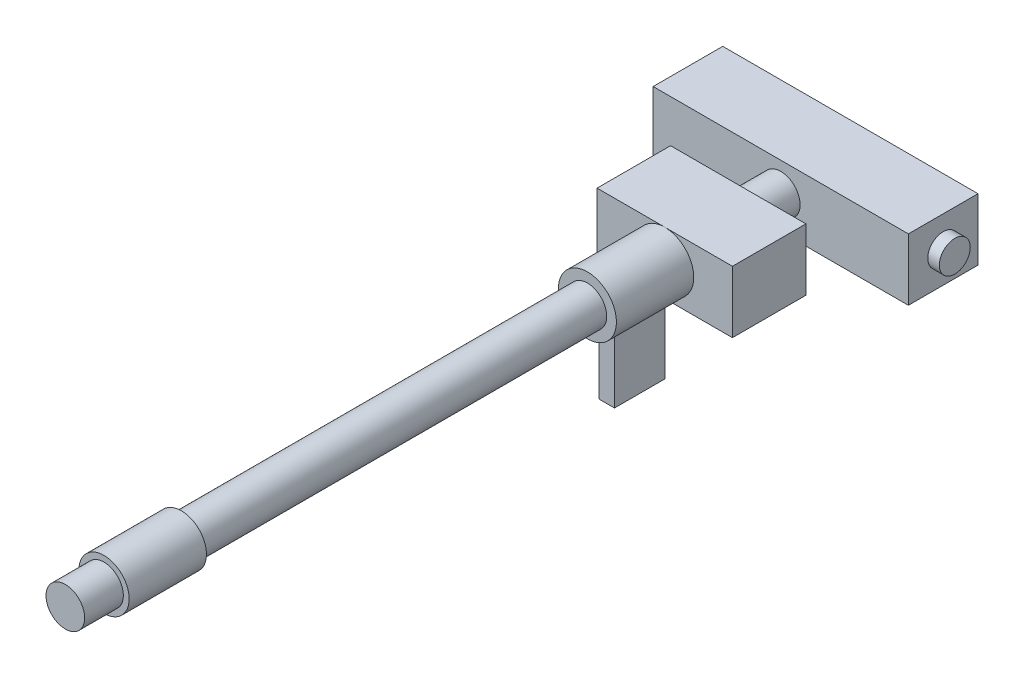
ISO-10303-21;
HEADER;
FILE_DESCRIPTION(('STEP AP214'),'2;1');
FILE_NAME('part.step','',(''),(''),'','','');
FILE_SCHEMA(('AUTOMOTIVE_DESIGN { 1 0 10303 214 1 1 1 1 }'));
ENDSEC;
DATA;
#1=APPLICATION_CONTEXT('core data for automotive mechanical design processes');
#2=APPLICATION_PROTOCOL_DEFINITION('international standard','automotive_design',2000,#1);
#3=PRODUCT_CONTEXT('',#1,'mechanical');
#4=PRODUCT('Part','Part','',(#3));
#5=PRODUCT_RELATED_PRODUCT_CATEGORY('part','',(#4));
#6=PRODUCT_DEFINITION_FORMATION('','',#4);
#7=PRODUCT_DEFINITION_CONTEXT('part definition',#1,'design');
#8=PRODUCT_DEFINITION('design','',#6,#7);
#9=PRODUCT_DEFINITION_SHAPE('','',#8);
#10=(LENGTH_UNIT() NAMED_UNIT(*) SI_UNIT(.MILLI.,.METRE.));
#11=(NAMED_UNIT(*) PLANE_ANGLE_UNIT() SI_UNIT($,.RADIAN.));
#12=(NAMED_UNIT(*) SI_UNIT($,.STERADIAN.) SOLID_ANGLE_UNIT());
#13=UNCERTAINTY_MEASURE_WITH_UNIT(LENGTH_MEASURE(1.E-05),#10,'distance_accuracy_value','');
#14=(GEOMETRIC_REPRESENTATION_CONTEXT(3) GLOBAL_UNCERTAINTY_ASSIGNED_CONTEXT((#13)) GLOBAL_UNIT_ASSIGNED_CONTEXT((#10,
#11,#12)) REPRESENTATION_CONTEXT('',''));
#15=CARTESIAN_POINT('',(0.,0.,0.));
#16=DIRECTION('',(0.,0.,1.));
#17=DIRECTION('',(1.,0.,0.));
#18=AXIS2_PLACEMENT_3D('',#15,#16,#17);
#19=CARTESIAN_POINT('',(757.894917120642,103.056875623706,-263.576726413165));
#20=DIRECTION('',(1.,0.,0.));
#21=DIRECTION('',(0.,0.,-1.));
#22=AXIS2_PLACEMENT_3D('',#19,#20,#21);
#23=PLANE('',#22);
#24=CARTESIAN_POINT('',(757.894917120642,100.315701745268,-267.056360518351));
#25=DIRECTION('',(1.,0.,0.));
#26=DIRECTION('',(0.,0.,-1.));
#27=AXIS2_PLACEMENT_3D('',#24,#25,#26);
#28=CIRCLE('',#27,4.);
#29=CARTESIAN_POINT('',(757.894917120642,100.315701745268,-271.056360518351));
#30=VERTEX_POINT('',#29);
#31=EDGE_CURVE('E20',#30,#30,#28,.T.);
#32=ORIENTED_EDGE('',*,*,#31,.F.);
#33=EDGE_LOOP('',(#32));
#34=FACE_BOUND('',#33,.T.);
#35=ADVANCED_FACE('F17',(#34),#23,.F.);
#36=CARTESIAN_POINT('',(829.894917120642,103.056875623706,-263.576726413165));
#37=DIRECTION('',(1.,0.,0.));
#38=DIRECTION('',(0.,0.,-1.));
#39=AXIS2_PLACEMENT_3D('',#36,#37,#38);
#40=PLANE('',#39);
#41=CARTESIAN_POINT('',(829.894917120642,100.315701745268,-267.056360518351));
#42=DIRECTION('',(1.,0.,0.));
#43=DIRECTION('',(0.,0.,-1.));
#44=AXIS2_PLACEMENT_3D('',#41,#42,#43);
#45=CIRCLE('',#44,4.);
#46=CARTESIAN_POINT('',(829.894917120642,100.315701745268,-271.056360518351));
#47=VERTEX_POINT('',#46);
#48=EDGE_CURVE('E119',#47,#47,#45,.F.);
#49=ORIENTED_EDGE('',*,*,#48,.F.);
#50=EDGE_LOOP('',(#49));
#51=FACE_BOUND('',#50,.T.);
#52=ADVANCED_FACE('F205',(#51),#40,.T.);
#53=CARTESIAN_POINT('',(757.894917120642,100.315701745268,-267.056360518351));
#54=DIRECTION('',(1.,0.,0.));
#55=DIRECTION('',(0.,0.,-1.));
#56=AXIS2_PLACEMENT_3D('',#53,#54,#55);
#57=CYLINDRICAL_SURFACE('',#56,4.);
#58=CARTESIAN_POINT('',(760.894917120642,100.315701745268,-267.056360518351));
#59=DIRECTION('',(1.,0.,0.));
#60=DIRECTION('',(0.,0.,-1.));
#61=AXIS2_PLACEMENT_3D('',#58,#59,#60);
#62=CIRCLE('',#61,4.);
#63=CARTESIAN_POINT('',(760.894917120642,100.315701745268,-271.056360518351));
#64=VERTEX_POINT('',#63);
#65=EDGE_CURVE('E127',#64,#64,#62,.T.);
#66=ORIENTED_EDGE('',*,*,#65,.F.);
#67=EDGE_LOOP('',(#66));
#68=FACE_BOUND('',#67,.T.);
#69=ORIENTED_EDGE('',*,*,#31,.T.);
#70=EDGE_LOOP('',(#69));
#71=FACE_BOUND('',#70,.T.);
#72=ADVANCED_FACE('F202',(#68,#71),#57,.T.);
#73=CARTESIAN_POINT('',(792.989878426496,104.310878070249,-276.056360518351));
#74=DIRECTION('',(0.,0.,-1.));
#75=DIRECTION('',(-1.,0.,0.));
#76=AXIS2_PLACEMENT_3D('',#73,#74,#75);
#77=PLANE('',#76);
#78=DIRECTION('',(1.,0.,0.));
#79=VECTOR('',#78,1.);
#80=CARTESIAN_POINT('',(556.61416335875,92.3157017452683,-276.056360518351));
#81=LINE('',#80,#79);
#82=CARTESIAN_POINT('',(826.894917120642,92.3157017452683,-276.056360518351));
#83=VERTEX_POINT('',#82);
#84=CARTESIAN_POINT('',(760.894917120642,92.3157017452683,-276.056360518351));
#85=VERTEX_POINT('',#84);
#86=EDGE_CURVE('E124',#83,#85,#81,.F.);
#87=ORIENTED_EDGE('',*,*,#86,.T.);
#88=DIRECTION('',(0.,1.,0.));
#89=VECTOR('',#88,1.);
#90=CARTESIAN_POINT('',(760.894917120642,108.315701745268,-276.056360518351));
#91=LINE('',#90,#89);
#92=CARTESIAN_POINT('',(760.894917120642,108.315701745268,-276.056360518351));
#93=VERTEX_POINT('',#92);
#94=EDGE_CURVE('E122',#93,#85,#91,.F.);
#95=ORIENTED_EDGE('',*,*,#94,.F.);
#96=DIRECTION('',(1.,0.,0.));
#97=VECTOR('',#96,1.);
#98=CARTESIAN_POINT('',(556.61416335875,108.315701745268,-276.056360518351));
#99=LINE('',#98,#97);
#100=CARTESIAN_POINT('',(826.894917120642,108.315701745268,-276.056360518351));
#101=VERTEX_POINT('',#100);
#102=EDGE_CURVE('E108',#101,#93,#99,.F.);
#103=ORIENTED_EDGE('',*,*,#102,.F.);
#104=DIRECTION('',(0.,1.,0.));
#105=VECTOR('',#104,1.);
#106=CARTESIAN_POINT('',(826.894917120642,108.315701745268,-276.056360518351));
#107=LINE('',#106,#105);
#108=EDGE_CURVE('E193',#83,#101,#107,.T.);
#109=ORIENTED_EDGE('',*,*,#108,.F.);
#110=EDGE_LOOP('',(#87,#95,#103,#109));
#111=FACE_BOUND('',#110,.T.);
#112=ADVANCED_FACE('F123',(#111),#77,.T.);
#113=CARTESIAN_POINT('',(826.894917120642,100.315701745268,-267.056360518351));
#114=DIRECTION('',(1.,0.,0.));
#115=DIRECTION('',(0.,0.,-1.));
#116=AXIS2_PLACEMENT_3D('',#113,#114,#115);
#117=CYLINDRICAL_SURFACE('',#116,4.);
#118=ORIENTED_EDGE('',*,*,#48,.T.);
#119=EDGE_LOOP('',(#118));
#120=FACE_BOUND('',#119,.T.);
#121=CARTESIAN_POINT('',(826.894917120642,100.315701745268,-267.056360518351));
#122=DIRECTION('',(1.,0.,0.));
#123=DIRECTION('',(0.,0.,-1.));
#124=AXIS2_PLACEMENT_3D('',#121,#122,#123);
#125=CIRCLE('',#124,4.);
#126=CARTESIAN_POINT('',(826.894917120642,100.315701745268,-271.056360518351));
#127=VERTEX_POINT('',#126);
#128=EDGE_CURVE('E189',#127,#127,#125,.F.);
#129=ORIENTED_EDGE('',*,*,#128,.F.);
#130=EDGE_LOOP('',(#129));
#131=FACE_BOUND('',#130,.T.);
#132=ADVANCED_FACE('F317',(#120,#131),#117,.T.);
#133=CARTESIAN_POINT('',(556.61416335875,108.315701745268,-58.6570709718798));
#134=DIRECTION('',(0.,1.,0.));
#135=DIRECTION('',(0.,0.,1.));
#136=AXIS2_PLACEMENT_3D('',#133,#134,#135);
#137=PLANE('',#136);
#138=DIRECTION('',(0.,0.,-1.));
#139=VECTOR('',#138,1.);
#140=CARTESIAN_POINT('',(826.894917120642,108.315701745268,-258.056360518351));
#141=LINE('',#140,#139);
#142=CARTESIAN_POINT('',(826.894917120642,108.315701745268,-258.056360518351));
#143=VERTEX_POINT('',#142);
#144=EDGE_CURVE('E115',#101,#143,#141,.F.);
#145=ORIENTED_EDGE('',*,*,#144,.F.);
#146=ORIENTED_EDGE('',*,*,#102,.T.);
#147=DIRECTION('',(0.,0.,1.));
#148=VECTOR('',#147,1.);
#149=CARTESIAN_POINT('',(760.894917120642,108.315701745268,-276.056360518351));
#150=LINE('',#149,#148);
#151=CARTESIAN_POINT('',(760.894917120642,108.315701745268,-258.056360518351));
#152=VERTEX_POINT('',#151);
#153=EDGE_CURVE('E112',#152,#93,#150,.F.);
#154=ORIENTED_EDGE('',*,*,#153,.F.);
#155=DIRECTION('',(1.,0.,0.));
#156=VECTOR('',#155,1.);
#157=CARTESIAN_POINT('',(793.894917120642,108.315701745268,-258.056360518351));
#158=LINE('',#157,#156);
#159=EDGE_CURVE('E192',#143,#152,#158,.F.);
#160=ORIENTED_EDGE('',*,*,#159,.F.);
#161=EDGE_LOOP('',(#145,#146,#154,#160));
#162=FACE_BOUND('',#161,.T.);
#163=ADVANCED_FACE('F110',(#162),#137,.T.);
#164=CARTESIAN_POINT('',(760.894917120642,108.315701745268,-276.056360518351));
#165=DIRECTION('',(-1.,0.,0.));
#166=DIRECTION('',(0.,0.,1.));
#167=AXIS2_PLACEMENT_3D('',#164,#165,#166);
#168=PLANE('',#167);
#169=ORIENTED_EDGE('',*,*,#65,.T.);
#170=EDGE_LOOP('',(#169));
#171=FACE_BOUND('',#170,.T.);
#172=DIRECTION('',(0.,0.,1.));
#173=VECTOR('',#172,1.);
#174=CARTESIAN_POINT('',(760.894917120642,92.3157017452683,-58.6570709718798));
#175=LINE('',#174,#173);
#176=CARTESIAN_POINT('',(760.894917120642,92.3157017452683,-258.056360518351));
#177=VERTEX_POINT('',#176);
#178=EDGE_CURVE('E195',#85,#177,#175,.T.);
#179=ORIENTED_EDGE('',*,*,#178,.T.);
#180=DIRECTION('',(0.,1.,0.));
#181=VECTOR('',#180,1.);
#182=CARTESIAN_POINT('',(760.894917120642,108.315701745268,-258.056360518351));
#183=LINE('',#182,#181);
#184=EDGE_CURVE('E131',#152,#177,#183,.F.);
#185=ORIENTED_EDGE('',*,*,#184,.F.);
#186=ORIENTED_EDGE('',*,*,#153,.T.);
#187=ORIENTED_EDGE('',*,*,#94,.T.);
#188=EDGE_LOOP('',(#179,#185,#186,#187));
#189=FACE_BOUND('',#188,.T.);
#190=ADVANCED_FACE('F129',(#171,#189),#168,.T.);
#191=CARTESIAN_POINT('',(556.61416335875,92.3157017452683,-58.6570709718798));
#192=DIRECTION('',(0.,1.,0.));
#193=DIRECTION('',(0.,0.,1.));
#194=AXIS2_PLACEMENT_3D('',#191,#192,#193);
#195=PLANE('',#194);
#196=DIRECTION('',(0.,0.,-1.));
#197=VECTOR('',#196,1.);
#198=CARTESIAN_POINT('',(826.894917120642,92.3157017452683,-258.056360518351));
#199=LINE('',#198,#197);
#200=CARTESIAN_POINT('',(826.894917120642,92.3157017452683,-258.056360518351));
#201=VERTEX_POINT('',#200);
#202=EDGE_CURVE('E525',#201,#83,#199,.T.);
#203=ORIENTED_EDGE('',*,*,#202,.F.);
#204=DIRECTION('',(1.,0.,0.));
#205=VECTOR('',#204,1.);
#206=CARTESIAN_POINT('',(793.894917120642,92.3157017452683,-258.056360518351));
#207=LINE('',#206,#205);
#208=EDGE_CURVE('E534',#177,#201,#207,.T.);
#209=ORIENTED_EDGE('',*,*,#208,.F.);
#210=ORIENTED_EDGE('',*,*,#178,.F.);
#211=ORIENTED_EDGE('',*,*,#86,.F.);
#212=EDGE_LOOP('',(#203,#209,#210,#211));
#213=FACE_BOUND('',#212,.T.);
#214=ADVANCED_FACE('F307',(#213),#195,.F.);
#215=CARTESIAN_POINT('',(826.894917120642,108.315701745268,-258.056360518351));
#216=DIRECTION('',(1.,0.,0.));
#217=DIRECTION('',(0.,0.,-1.));
#218=AXIS2_PLACEMENT_3D('',#215,#216,#217);
#219=PLANE('',#218);
#220=ORIENTED_EDGE('',*,*,#128,.T.);
#221=EDGE_LOOP('',(#220));
#222=FACE_BOUND('',#221,.T.);
#223=ORIENTED_EDGE('',*,*,#202,.T.);
#224=ORIENTED_EDGE('',*,*,#108,.T.);
#225=ORIENTED_EDGE('',*,*,#144,.T.);
#226=DIRECTION('',(0.,1.,0.));
#227=VECTOR('',#226,1.);
#228=CARTESIAN_POINT('',(826.894917120642,108.315701745268,-258.056360518351));
#229=LINE('',#228,#227);
#230=EDGE_CURVE('E188',#201,#143,#229,.T.);
#231=ORIENTED_EDGE('',*,*,#230,.F.);
#232=EDGE_LOOP('',(#223,#224,#225,#231));
#233=FACE_BOUND('',#232,.T.);
#234=ADVANCED_FACE('F303',(#222,#233),#219,.T.);
#235=CARTESIAN_POINT('',(793.894917120642,108.315701745268,-258.056360518351));
#236=DIRECTION('',(0.,0.,1.));
#237=DIRECTION('',(1.,0.,0.));
#238=AXIS2_PLACEMENT_3D('',#235,#236,#237);
#239=PLANE('',#238);
#240=CARTESIAN_POINT('',(793.894917120642,100.815701745268,-258.056360518351));
#241=DIRECTION('',(0.,0.,-1.));
#242=DIRECTION('',(-1.,0.,0.));
#243=AXIS2_PLACEMENT_3D('',#240,#241,#242);
#244=CIRCLE('',#243,5.);
#245=CARTESIAN_POINT('',(788.894917120642,100.815701745268,-258.056360518351));
#246=VERTEX_POINT('',#245);
#247=EDGE_CURVE('E185',#246,#246,#244,.F.);
#248=ORIENTED_EDGE('',*,*,#247,.F.);
#249=EDGE_LOOP('',(#248));
#250=FACE_BOUND('',#249,.T.);
#251=ORIENTED_EDGE('',*,*,#208,.T.);
#252=ORIENTED_EDGE('',*,*,#230,.T.);
#253=ORIENTED_EDGE('',*,*,#159,.T.);
#254=ORIENTED_EDGE('',*,*,#184,.T.);
#255=EDGE_LOOP('',(#251,#252,#253,#254));
#256=FACE_BOUND('',#255,.T.);
#257=ADVANCED_FACE('F299',(#250,#256),#239,.T.);
#258=CARTESIAN_POINT('',(781.811123026391,99.3157017452683,-242.945206063473));
#259=DIRECTION('',(0.,-1.,0.));
#260=DIRECTION('',(0.,0.,-1.));
#261=AXIS2_PLACEMENT_3D('',#258,#259,#260);
#262=PLANE('',#261);
#263=CARTESIAN_POINT('',(793.894917120642,99.3157017452683,-241.556360518351));
#264=DIRECTION('',(0.,-1.,0.));
#265=DIRECTION('',(0.,0.,-1.));
#266=AXIS2_PLACEMENT_3D('',#263,#264,#265);
#267=CIRCLE('',#266,3.);
#268=CARTESIAN_POINT('',(793.894917120642,99.3157017452683,-244.556360518351));
#269=VERTEX_POINT('',#268);
#270=EDGE_CURVE('E182',#269,#269,#267,.T.);
#271=ORIENTED_EDGE('',*,*,#270,.T.);
#272=EDGE_LOOP('',(#271));
#273=FACE_BOUND('',#272,.T.);
#274=ADVANCED_FACE('F295',(#273),#262,.T.);
#275=CARTESIAN_POINT('',(793.894917120642,100.815701745268,-73.0563605183514));
#276=DIRECTION('',(0.,0.,-1.));
#277=DIRECTION('',(-1.,0.,0.));
#278=AXIS2_PLACEMENT_3D('',#275,#276,#277);
#279=CYLINDRICAL_SURFACE('',#278,5.);
#280=CARTESIAN_POINT('',(793.894917120642,100.815701745268,-247.056360518351));
#281=DIRECTION('',(0.,0.,-1.));
#282=DIRECTION('',(-1.,0.,0.));
#283=AXIS2_PLACEMENT_3D('',#280,#281,#282);
#284=CIRCLE('',#283,5.);
#285=CARTESIAN_POINT('',(788.894917120642,100.815701745268,-247.056360518351));
#286=VERTEX_POINT('',#285);
#287=EDGE_CURVE('E179',#286,#286,#284,.F.);
#288=ORIENTED_EDGE('',*,*,#287,.F.);
#289=EDGE_LOOP('',(#288));
#290=FACE_BOUND('',#289,.T.);
#291=ORIENTED_EDGE('',*,*,#247,.T.);
#292=EDGE_LOOP('',(#291));
#293=FACE_BOUND('',#292,.T.);
#294=ADVANCED_FACE('F291',(#290,#293),#279,.T.);
#295=CARTESIAN_POINT('',(792.989878426496,104.310878070249,-73.0563605183514));
#296=DIRECTION('',(0.,0.,-1.));
#297=DIRECTION('',(-1.,0.,0.));
#298=AXIS2_PLACEMENT_3D('',#295,#296,#297);
#299=PLANE('',#298);
#300=CARTESIAN_POINT('',(793.894917120642,100.815701745268,-73.0563605183514));
#301=DIRECTION('',(0.,0.,-1.));
#302=DIRECTION('',(-1.,0.,0.));
#303=AXIS2_PLACEMENT_3D('',#300,#301,#302);
#304=CIRCLE('',#303,5.);
#305=CARTESIAN_POINT('',(788.894917120642,100.815701745268,-73.0563605183514));
#306=VERTEX_POINT('',#305);
#307=EDGE_CURVE('E176',#306,#306,#304,.T.);
#308=ORIENTED_EDGE('',*,*,#307,.F.);
#309=EDGE_LOOP('',(#308));
#310=FACE_BOUND('',#309,.T.);
#311=ADVANCED_FACE('F287',(#310),#299,.F.);
#312=CARTESIAN_POINT('',(793.894917120642,84.3157017452683,-241.556360518351));
#313=DIRECTION('',(0.,-1.,0.));
#314=DIRECTION('',(0.,0.,-1.));
#315=AXIS2_PLACEMENT_3D('',#312,#313,#314);
#316=CYLINDRICAL_SURFACE('',#315,3.);
#317=ORIENTED_EDGE('',*,*,#270,.F.);
#318=EDGE_LOOP('',(#317));
#319=FACE_BOUND('',#318,.T.);
#320=CARTESIAN_POINT('',(793.894917120642,92.3157017452683,-241.556360518351));
#321=DIRECTION('',(0.,-1.,0.));
#322=DIRECTION('',(0.,0.,-1.));
#323=AXIS2_PLACEMENT_3D('',#320,#321,#322);
#324=CIRCLE('',#323,3.);
#325=CARTESIAN_POINT('',(793.894917120642,92.3157017452683,-244.556360518351));
#326=VERTEX_POINT('',#325);
#327=EDGE_CURVE('E172',#326,#326,#324,.T.);
#328=ORIENTED_EDGE('',*,*,#327,.T.);
#329=EDGE_LOOP('',(#328));
#330=FACE_BOUND('',#329,.T.);
#331=ADVANCED_FACE('F283',(#319,#330),#316,.F.);
#332=CARTESIAN_POINT('',(793.894917120642,108.315701745268,-247.056360518351));
#333=DIRECTION('',(0.,0.,-1.));
#334=DIRECTION('',(-1.,0.,0.));
#335=AXIS2_PLACEMENT_3D('',#332,#333,#334);
#336=PLANE('',#335);
#337=ORIENTED_EDGE('',*,*,#287,.T.);
#338=EDGE_LOOP('',(#337));
#339=FACE_BOUND('',#338,.T.);
#340=DIRECTION('',(1.,0.,0.));
#341=VECTOR('',#340,1.);
#342=CARTESIAN_POINT('',(556.61416335875,92.3157017452683,-247.056360518351));
#343=LINE('',#342,#341);
#344=CARTESIAN_POINT('',(811.394492429421,92.3157017452683,-247.056360518351));
#345=VERTEX_POINT('',#344);
#346=CARTESIAN_POINT('',(776.395341811863,92.3157017452683,-247.056360518351));
#347=VERTEX_POINT('',#346);
#348=EDGE_CURVE('E542',#345,#347,#343,.F.);
#349=ORIENTED_EDGE('',*,*,#348,.T.);
#350=DIRECTION('',(0.,1.,0.));
#351=VECTOR('',#350,1.);
#352=CARTESIAN_POINT('',(776.395341811863,108.315701745268,-247.056360518351));
#353=LINE('',#352,#351);
#354=CARTESIAN_POINT('',(776.395341811863,108.315701745268,-247.056360518351));
#355=VERTEX_POINT('',#354);
#356=EDGE_CURVE('E76',#355,#347,#353,.F.);
#357=ORIENTED_EDGE('',*,*,#356,.F.);
#358=DIRECTION('',(1.,0.,0.));
#359=VECTOR('',#358,1.);
#360=CARTESIAN_POINT('',(556.61416335875,108.315701745268,-247.056360518351));
#361=LINE('',#360,#359);
#362=CARTESIAN_POINT('',(811.394492429421,108.315701745268,-247.056360518351));
#363=VERTEX_POINT('',#362);
#364=EDGE_CURVE('E549',#363,#355,#361,.F.);
#365=ORIENTED_EDGE('',*,*,#364,.F.);
#366=DIRECTION('',(0.,1.,0.));
#367=VECTOR('',#366,1.);
#368=CARTESIAN_POINT('',(811.394492429421,108.315701745268,-247.056360518351));
#369=LINE('',#368,#367);
#370=EDGE_CURVE('E553',#345,#363,#369,.T.);
#371=ORIENTED_EDGE('',*,*,#370,.F.);
#372=EDGE_LOOP('',(#349,#357,#365,#371));
#373=FACE_BOUND('',#372,.T.);
#374=ADVANCED_FACE('F279',(#339,#373),#336,.T.);
#375=CARTESIAN_POINT('',(793.894917120642,100.815701745268,-73.0563605183514));
#376=DIRECTION('',(0.,0.,-1.));
#377=DIRECTION('',(-1.,0.,0.));
#378=AXIS2_PLACEMENT_3D('',#375,#376,#377);
#379=CYLINDRICAL_SURFACE('',#378,5.);
#380=ORIENTED_EDGE('',*,*,#307,.T.);
#381=EDGE_LOOP('',(#380));
#382=FACE_BOUND('',#381,.T.);
#383=CARTESIAN_POINT('',(793.894917120642,100.815701745268,-83.0563605183514));
#384=DIRECTION('',(0.,0.,-1.));
#385=DIRECTION('',(-1.,0.,0.));
#386=AXIS2_PLACEMENT_3D('',#383,#384,#385);
#387=CIRCLE('',#386,5.);
#388=CARTESIAN_POINT('',(788.894917120642,100.815701745268,-83.0563605183514));
#389=VERTEX_POINT('',#388);
#390=EDGE_CURVE('E168',#389,#389,#387,.F.);
#391=ORIENTED_EDGE('',*,*,#390,.T.);
#392=EDGE_LOOP('',(#391));
#393=FACE_BOUND('',#392,.T.);
#394=ADVANCED_FACE('F276',(#382,#393),#379,.T.);
#395=CARTESIAN_POINT('',(776.395341811863,108.315701745268,-247.056360518351));
#396=DIRECTION('',(-1.,0.,0.));
#397=DIRECTION('',(0.,0.,1.));
#398=AXIS2_PLACEMENT_3D('',#395,#396,#397);
#399=PLANE('',#398);
#400=DIRECTION('',(0.,0.,1.));
#401=VECTOR('',#400,1.);
#402=CARTESIAN_POINT('',(776.395341811863,92.3157017452683,-58.6570709718798));
#403=LINE('',#402,#401);
#404=CARTESIAN_POINT('',(776.395341811863,92.3157017452683,-228.056360518351));
#405=VERTEX_POINT('',#404);
#406=EDGE_CURVE('E60',#347,#405,#403,.T.);
#407=ORIENTED_EDGE('',*,*,#406,.T.);
#408=DIRECTION('',(0.,1.,0.));
#409=VECTOR('',#408,1.);
#410=CARTESIAN_POINT('',(776.395341811863,108.315701745268,-228.056360518351));
#411=LINE('',#410,#409);
#412=CARTESIAN_POINT('',(776.395341811863,108.315701745268,-228.056360518351));
#413=VERTEX_POINT('',#412);
#414=EDGE_CURVE('E166',#413,#405,#411,.F.);
#415=ORIENTED_EDGE('',*,*,#414,.F.);
#416=DIRECTION('',(0.,0.,1.));
#417=VECTOR('',#416,1.);
#418=CARTESIAN_POINT('',(776.395341811863,108.315701745268,-58.6570709718798));
#419=LINE('',#418,#417);
#420=EDGE_CURVE('E552',#355,#413,#419,.T.);
#421=ORIENTED_EDGE('',*,*,#420,.F.);
#422=ORIENTED_EDGE('',*,*,#356,.T.);
#423=EDGE_LOOP('',(#407,#415,#421,#422));
#424=FACE_BOUND('',#423,.T.);
#425=ADVANCED_FACE('F272',(#424),#399,.T.);
#426=CARTESIAN_POINT('',(556.61416335875,92.3157017452683,-58.6570709718798));
#427=DIRECTION('',(0.,1.,0.));
#428=DIRECTION('',(0.,0.,1.));
#429=AXIS2_PLACEMENT_3D('',#426,#427,#428);
#430=PLANE('',#429);
#431=ORIENTED_EDGE('',*,*,#327,.F.);
#432=EDGE_LOOP('',(#431));
#433=FACE_BOUND('',#432,.T.);
#434=DIRECTION('',(1.,0.,0.));
#435=VECTOR('',#434,1.);
#436=CARTESIAN_POINT('',(793.894917120642,92.3157017452683,-228.056360518351));
#437=LINE('',#436,#435);
#438=CARTESIAN_POINT('',(811.394492429421,92.3157017452683,-228.056360518351));
#439=VERTEX_POINT('',#438);
#440=EDGE_CURVE('E163',#405,#439,#437,.T.);
#441=ORIENTED_EDGE('',*,*,#440,.F.);
#442=ORIENTED_EDGE('',*,*,#406,.F.);
#443=ORIENTED_EDGE('',*,*,#348,.F.);
#444=DIRECTION('',(0.,0.,-1.));
#445=VECTOR('',#444,1.);
#446=CARTESIAN_POINT('',(811.394492429421,92.3157017452683,-228.056360518351));
#447=LINE('',#446,#445);
#448=EDGE_CURVE('E175',#439,#345,#447,.T.);
#449=ORIENTED_EDGE('',*,*,#448,.F.);
#450=EDGE_LOOP('',(#441,#442,#443,#449));
#451=FACE_BOUND('',#450,.T.);
#452=ADVANCED_FACE('F268',(#433,#451),#430,.F.);
#453=CARTESIAN_POINT('',(811.394492429421,108.315701745268,-228.056360518351));
#454=DIRECTION('',(1.,0.,0.));
#455=DIRECTION('',(0.,0.,-1.));
#456=AXIS2_PLACEMENT_3D('',#453,#454,#455);
#457=PLANE('',#456);
#458=ORIENTED_EDGE('',*,*,#448,.T.);
#459=ORIENTED_EDGE('',*,*,#370,.T.);
#460=DIRECTION('',(0.,0.,1.));
#461=VECTOR('',#460,1.);
#462=CARTESIAN_POINT('',(811.394492429421,108.315701745268,-58.6570709718798));
#463=LINE('',#462,#461);
#464=CARTESIAN_POINT('',(811.394492429421,108.315701745268,-228.056360518351));
#465=VERTEX_POINT('',#464);
#466=EDGE_CURVE('E171',#465,#363,#463,.F.);
#467=ORIENTED_EDGE('',*,*,#466,.F.);
#468=DIRECTION('',(0.,1.,0.));
#469=VECTOR('',#468,1.);
#470=CARTESIAN_POINT('',(811.394492429421,108.315701745268,-228.056360518351));
#471=LINE('',#470,#469);
#472=EDGE_CURVE('E161',#439,#465,#471,.T.);
#473=ORIENTED_EDGE('',*,*,#472,.F.);
#474=EDGE_LOOP('',(#458,#459,#467,#473));
#475=FACE_BOUND('',#474,.T.);
#476=ADVANCED_FACE('F264',(#475),#457,.T.);
#477=CARTESIAN_POINT('',(556.61416335875,108.315701745268,-58.6570709718798));
#478=DIRECTION('',(0.,1.,0.));
#479=DIRECTION('',(0.,0.,1.));
#480=AXIS2_PLACEMENT_3D('',#477,#478,#479);
#481=PLANE('',#480);
#482=DIRECTION('',(1.,0.,0.));
#483=VECTOR('',#482,1.);
#484=CARTESIAN_POINT('',(793.894917120642,108.315701745268,-228.056360518351));
#485=LINE('',#484,#483);
#486=EDGE_CURVE('E68',#465,#413,#485,.F.);
#487=ORIENTED_EDGE('',*,*,#486,.F.);
#488=ORIENTED_EDGE('',*,*,#466,.T.);
#489=ORIENTED_EDGE('',*,*,#364,.T.);
#490=ORIENTED_EDGE('',*,*,#420,.T.);
#491=EDGE_LOOP('',(#487,#488,#489,#490));
#492=FACE_BOUND('',#491,.T.);
#493=ADVANCED_FACE('F260',(#492),#481,.T.);
#494=CARTESIAN_POINT('',(793.894917120642,76.3157017452683,-226.056360518351));
#495=DIRECTION('',(0.,-1.,0.));
#496=DIRECTION('',(0.,0.,-1.));
#497=AXIS2_PLACEMENT_3D('',#494,#495,#496);
#498=PLANE('',#497);
#499=DIRECTION('',(1.,0.,0.));
#500=VECTOR('',#499,1.);
#501=CARTESIAN_POINT('',(793.894917120642,76.3157017452683,-213.056360518351));
#502=LINE('',#501,#500);
#503=CARTESIAN_POINT('',(791.894917120642,76.3157017452683,-213.056360518351));
#504=VERTEX_POINT('',#503);
#505=CARTESIAN_POINT('',(795.894917120642,76.3157017452683,-213.056360518351));
#506=VERTEX_POINT('',#505);
#507=EDGE_CURVE('E160',#504,#506,#502,.T.);
#508=ORIENTED_EDGE('',*,*,#507,.F.);
#509=DIRECTION('',(0.,0.,1.));
#510=VECTOR('',#509,1.);
#511=CARTESIAN_POINT('',(791.894917120642,76.3157017452683,-208.056360518351));
#512=LINE('',#511,#510);
#513=CARTESIAN_POINT('',(791.894917120642,76.3157017452683,-226.056360518351));
#514=VERTEX_POINT('',#513);
#515=EDGE_CURVE('E158',#514,#504,#512,.T.);
#516=ORIENTED_EDGE('',*,*,#515,.F.);
#517=DIRECTION('',(-1.,0.,0.));
#518=VECTOR('',#517,1.);
#519=CARTESIAN_POINT('',(793.894917120642,76.3157017452683,-226.056360518351));
#520=LINE('',#519,#518);
#521=CARTESIAN_POINT('',(795.894917120642,76.3157017452683,-226.056360518351));
#522=VERTEX_POINT('',#521);
#523=EDGE_CURVE('E577',#522,#514,#520,.T.);
#524=ORIENTED_EDGE('',*,*,#523,.F.);
#525=DIRECTION('',(0.,0.,1.));
#526=VECTOR('',#525,1.);
#527=CARTESIAN_POINT('',(795.894917120642,76.3157017452683,-208.056360518351));
#528=LINE('',#527,#526);
#529=EDGE_CURVE('E574',#522,#506,#528,.T.);
#530=ORIENTED_EDGE('',*,*,#529,.T.);
#531=EDGE_LOOP('',(#508,#516,#524,#530));
#532=FACE_BOUND('',#531,.T.);
#533=ADVANCED_FACE('F256',(#532),#498,.T.);
#534=CARTESIAN_POINT('',(792.989878426496,104.310878070249,-83.0563605183514));
#535=DIRECTION('',(0.,0.,-1.));
#536=DIRECTION('',(-1.,0.,0.));
#537=AXIS2_PLACEMENT_3D('',#534,#535,#536);
#538=PLANE('',#537);
#539=CARTESIAN_POINT('',(793.894917120642,100.815701745268,-83.0563605183514));
#540=DIRECTION('',(0.,0.,-1.));
#541=DIRECTION('',(-1.,0.,0.));
#542=AXIS2_PLACEMENT_3D('',#539,#540,#541);
#543=CIRCLE('',#542,6.5);
#544=CARTESIAN_POINT('',(787.394917120642,100.815701745268,-83.0563605183514));
#545=VERTEX_POINT('',#544);
#546=EDGE_CURVE('E155',#545,#545,#543,.T.);
#547=ORIENTED_EDGE('',*,*,#546,.F.);
#548=EDGE_LOOP('',(#547));
#549=FACE_BOUND('',#548,.T.);
#550=ORIENTED_EDGE('',*,*,#390,.F.);
#551=EDGE_LOOP('',(#550));
#552=FACE_BOUND('',#551,.T.);
#553=ADVANCED_FACE('F253',(#549,#552),#538,.F.);
#554=CARTESIAN_POINT('',(793.894917120642,108.315701745268,-228.056360518351));
#555=DIRECTION('',(0.,0.,1.));
#556=DIRECTION('',(1.,0.,0.));
#557=AXIS2_PLACEMENT_3D('',#554,#555,#556);
#558=PLANE('',#557);
#559=ORIENTED_EDGE('',*,*,#472,.T.);
#560=ORIENTED_EDGE('',*,*,#486,.T.);
#561=ORIENTED_EDGE('',*,*,#414,.T.);
#562=ORIENTED_EDGE('',*,*,#440,.T.);
#563=EDGE_LOOP('',(#559,#560,#561,#562));
#564=FACE_BOUND('',#563,.T.);
#565=CARTESIAN_POINT('',(793.894917120642,100.815701745268,-228.056360518351));
#566=DIRECTION('',(0.,0.,-1.));
#567=DIRECTION('',(-1.,0.,0.));
#568=AXIS2_PLACEMENT_3D('',#565,#566,#567);
#569=CIRCLE('',#568,7.5);
#570=CARTESIAN_POINT('',(786.394917120642,100.815701745268,-228.056360518351));
#571=VERTEX_POINT('',#570);
#572=EDGE_CURVE('E152',#571,#571,#569,.F.);
#573=ORIENTED_EDGE('',*,*,#572,.F.);
#574=EDGE_LOOP('',(#573));
#575=FACE_BOUND('',#574,.T.);
#576=ADVANCED_FACE('F249',(#564,#575),#558,.T.);
#577=CARTESIAN_POINT('',(793.894917120642,96.816548,-213.056360518351));
#578=DIRECTION('',(0.,0.,1.));
#579=DIRECTION('',(1.,0.,0.));
#580=AXIS2_PLACEMENT_3D('',#577,#578,#579);
#581=PLANE('',#580);
#582=ORIENTED_EDGE('',*,*,#507,.T.);
#583=DIRECTION('',(0.,1.,0.));
#584=VECTOR('',#583,1.);
#585=CARTESIAN_POINT('',(795.894917120642,100.815701745268,-213.056360518351));
#586=LINE('',#585,#584);
#587=CARTESIAN_POINT('',(795.894917120642,93.5872855978675,-213.056360518351));
#588=VERTEX_POINT('',#587);
#589=EDGE_CURVE('E578',#506,#588,#586,.T.);
#590=ORIENTED_EDGE('',*,*,#589,.T.);
#591=CARTESIAN_POINT('',(793.894917120642,100.815701745268,-213.056360518351));
#592=DIRECTION('',(0.,0.,-1.));
#593=DIRECTION('',(-1.,0.,0.));
#594=AXIS2_PLACEMENT_3D('',#591,#592,#593);
#595=CIRCLE('',#594,7.5);
#596=CARTESIAN_POINT('',(791.894917120642,93.5872855978675,-213.056360518351));
#597=VERTEX_POINT('',#596);
#598=EDGE_CURVE('E149',#597,#588,#595,.F.);
#599=ORIENTED_EDGE('',*,*,#598,.F.);
#600=DIRECTION('',(0.,1.,0.));
#601=VECTOR('',#600,1.);
#602=CARTESIAN_POINT('',(791.894917120642,100.815701745268,-213.056360518351));
#603=LINE('',#602,#601);
#604=EDGE_CURVE('E593',#504,#597,#603,.T.);
#605=ORIENTED_EDGE('',*,*,#604,.F.);
#606=EDGE_LOOP('',(#582,#590,#599,#605));
#607=FACE_BOUND('',#606,.T.);
#608=ADVANCED_FACE('F245',(#607),#581,.T.);
#609=CARTESIAN_POINT('',(795.894917120642,100.815701745268,-208.056360518351));
#610=DIRECTION('',(-1.,0.,0.));
#611=DIRECTION('',(0.,0.,1.));
#612=AXIS2_PLACEMENT_3D('',#609,#610,#611);
#613=PLANE('',#612);
#614=DIRECTION('',(0.,1.,0.));
#615=VECTOR('',#614,1.);
#616=CARTESIAN_POINT('',(795.894917120642,76.3157017452683,-226.056360518351));
#617=LINE('',#616,#615);
#618=CARTESIAN_POINT('',(795.894917120642,93.5872855978675,-226.056360518351));
#619=VERTEX_POINT('',#618);
#620=EDGE_CURVE('E590',#619,#522,#617,.F.);
#621=ORIENTED_EDGE('',*,*,#620,.F.);
#622=DIRECTION('',(0.,0.,-1.));
#623=VECTOR('',#622,1.);
#624=CARTESIAN_POINT('',(795.894917120642,93.5872855978675,-208.056360518351));
#625=LINE('',#624,#623);
#626=EDGE_CURVE('E148',#588,#619,#625,.T.);
#627=ORIENTED_EDGE('',*,*,#626,.F.);
#628=ORIENTED_EDGE('',*,*,#589,.F.);
#629=ORIENTED_EDGE('',*,*,#529,.F.);
#630=EDGE_LOOP('',(#621,#627,#628,#629));
#631=FACE_BOUND('',#630,.T.);
#632=ADVANCED_FACE('F242',(#631),#613,.F.);
#633=CARTESIAN_POINT('',(793.894917120642,76.3157017452683,-226.056360518351));
#634=DIRECTION('',(0.,0.,-1.));
#635=DIRECTION('',(-1.,0.,0.));
#636=AXIS2_PLACEMENT_3D('',#633,#634,#635);
#637=PLANE('',#636);
#638=CARTESIAN_POINT('',(793.894917120642,100.815701745268,-226.056360518351));
#639=DIRECTION('',(0.,0.,-1.));
#640=DIRECTION('',(-1.,0.,0.));
#641=AXIS2_PLACEMENT_3D('',#638,#639,#640);
#642=CIRCLE('',#641,7.5);
#643=CARTESIAN_POINT('',(791.894917120642,93.5872855978675,-226.056360518351));
#644=VERTEX_POINT('',#643);
#645=EDGE_CURVE('E145',#619,#644,#642,.T.);
#646=ORIENTED_EDGE('',*,*,#645,.F.);
#647=ORIENTED_EDGE('',*,*,#620,.T.);
#648=ORIENTED_EDGE('',*,*,#523,.T.);
#649=DIRECTION('',(0.,1.,0.));
#650=VECTOR('',#649,1.);
#651=CARTESIAN_POINT('',(791.894917120642,100.815701745268,-226.056360518351));
#652=LINE('',#651,#650);
#653=EDGE_CURVE('E35',#644,#514,#652,.F.);
#654=ORIENTED_EDGE('',*,*,#653,.F.);
#655=EDGE_LOOP('',(#646,#647,#648,#654));
#656=FACE_BOUND('',#655,.T.);
#657=ADVANCED_FACE('F238',(#656),#637,.T.);
#658=CARTESIAN_POINT('',(791.894917120642,100.815701745268,-208.056360518351));
#659=DIRECTION('',(-1.,0.,0.));
#660=DIRECTION('',(0.,0.,1.));
#661=AXIS2_PLACEMENT_3D('',#658,#659,#660);
#662=PLANE('',#661);
#663=ORIENTED_EDGE('',*,*,#653,.T.);
#664=ORIENTED_EDGE('',*,*,#515,.T.);
#665=ORIENTED_EDGE('',*,*,#604,.T.);
#666=DIRECTION('',(0.,0.,-1.));
#667=VECTOR('',#666,1.);
#668=CARTESIAN_POINT('',(791.894917120642,93.5872855978675,-208.056360518351));
#669=LINE('',#668,#667);
#670=EDGE_CURVE('E144',#644,#597,#669,.F.);
#671=ORIENTED_EDGE('',*,*,#670,.F.);
#672=EDGE_LOOP('',(#663,#664,#665,#671));
#673=FACE_BOUND('',#672,.T.);
#674=ADVANCED_FACE('F234',(#673),#662,.T.);
#675=CARTESIAN_POINT('',(793.894917120642,100.815701745268,-83.0563605183514));
#676=DIRECTION('',(0.,0.,-1.));
#677=DIRECTION('',(-1.,0.,0.));
#678=AXIS2_PLACEMENT_3D('',#675,#676,#677);
#679=CYLINDRICAL_SURFACE('',#678,6.5);
#680=CARTESIAN_POINT('',(793.894917120642,100.815701745268,-103.056360518351));
#681=DIRECTION('',(0.,0.,-1.));
#682=DIRECTION('',(-1.,0.,0.));
#683=AXIS2_PLACEMENT_3D('',#680,#681,#682);
#684=CIRCLE('',#683,6.5);
#685=CARTESIAN_POINT('',(787.394917120642,100.815701745268,-103.056360518351));
#686=VERTEX_POINT('',#685);
#687=EDGE_CURVE('E141',#686,#686,#684,.T.);
#688=ORIENTED_EDGE('',*,*,#687,.F.);
#689=EDGE_LOOP('',(#688));
#690=FACE_BOUND('',#689,.T.);
#691=ORIENTED_EDGE('',*,*,#546,.T.);
#692=EDGE_LOOP('',(#691));
#693=FACE_BOUND('',#692,.T.);
#694=ADVANCED_FACE('F230',(#690,#693),#679,.T.);
#695=CARTESIAN_POINT('',(793.894917120642,100.815701745268,-208.056360518351));
#696=DIRECTION('',(0.,0.,-1.));
#697=DIRECTION('',(-1.,0.,0.));
#698=AXIS2_PLACEMENT_3D('',#695,#696,#697);
#699=CYLINDRICAL_SURFACE('',#698,7.5);
#700=ORIENTED_EDGE('',*,*,#572,.T.);
#701=EDGE_LOOP('',(#700));
#702=FACE_BOUND('',#701,.T.);
#703=ORIENTED_EDGE('',*,*,#645,.T.);
#704=ORIENTED_EDGE('',*,*,#670,.T.);
#705=ORIENTED_EDGE('',*,*,#598,.T.);
#706=ORIENTED_EDGE('',*,*,#626,.T.);
#707=EDGE_LOOP('',(#703,#704,#705,#706));
#708=FACE_BOUND('',#707,.T.);
#709=CARTESIAN_POINT('',(793.894917120642,100.815701745268,-208.056360518351));
#710=DIRECTION('',(0.,0.,-1.));
#711=DIRECTION('',(-1.,0.,0.));
#712=AXIS2_PLACEMENT_3D('',#709,#710,#711);
#713=CIRCLE('',#712,7.5);
#714=CARTESIAN_POINT('',(786.394917120642,100.815701745268,-208.056360518351));
#715=VERTEX_POINT('',#714);
#716=EDGE_CURVE('E138',#715,#715,#713,.T.);
#717=ORIENTED_EDGE('',*,*,#716,.T.);
#718=EDGE_LOOP('',(#717));
#719=FACE_BOUND('',#718,.T.);
#720=ADVANCED_FACE('F226',(#702,#708,#719),#699,.T.);
#721=CARTESIAN_POINT('',(792.989878426496,104.310878070249,-103.056360518351));
#722=DIRECTION('',(0.,0.,-1.));
#723=DIRECTION('',(-1.,0.,0.));
#724=AXIS2_PLACEMENT_3D('',#721,#722,#723);
#725=PLANE('',#724);
#726=ORIENTED_EDGE('',*,*,#687,.T.);
#727=EDGE_LOOP('',(#726));
#728=FACE_BOUND('',#727,.T.);
#729=CARTESIAN_POINT('',(793.894917120642,100.815701745268,-103.056360518351));
#730=DIRECTION('',(0.,0.,-1.));
#731=DIRECTION('',(-1.,0.,0.));
#732=AXIS2_PLACEMENT_3D('',#729,#730,#731);
#733=CIRCLE('',#732,5.);
#734=CARTESIAN_POINT('',(788.894917120642,100.815701745268,-103.056360518351));
#735=VERTEX_POINT('',#734);
#736=EDGE_CURVE('E26',#735,#735,#733,.T.);
#737=ORIENTED_EDGE('',*,*,#736,.F.);
#738=EDGE_LOOP('',(#737));
#739=FACE_BOUND('',#738,.T.);
#740=ADVANCED_FACE('F219',(#728,#739),#725,.T.);
#741=CARTESIAN_POINT('',(792.989878426496,104.310878070249,-208.056360518351));
#742=DIRECTION('',(0.,0.,-1.));
#743=DIRECTION('',(-1.,0.,0.));
#744=AXIS2_PLACEMENT_3D('',#741,#742,#743);
#745=PLANE('',#744);
#746=CARTESIAN_POINT('',(793.894917120642,100.815701745268,-208.056360518351));
#747=DIRECTION('',(0.,0.,-1.));
#748=DIRECTION('',(-1.,0.,0.));
#749=AXIS2_PLACEMENT_3D('',#746,#747,#748);
#750=CIRCLE('',#749,5.);
#751=CARTESIAN_POINT('',(788.894917120642,100.815701745268,-208.056360518351));
#752=VERTEX_POINT('',#751);
#753=EDGE_CURVE('E11',#752,#752,#750,.F.);
#754=ORIENTED_EDGE('',*,*,#753,.F.);
#755=EDGE_LOOP('',(#754));
#756=FACE_BOUND('',#755,.T.);
#757=ORIENTED_EDGE('',*,*,#716,.F.);
#758=EDGE_LOOP('',(#757));
#759=FACE_BOUND('',#758,.T.);
#760=ADVANCED_FACE('F213',(#756,#759),#745,.F.);
#761=CARTESIAN_POINT('',(793.894917120642,100.815701745268,-73.0563605183514));
#762=DIRECTION('',(0.,0.,-1.));
#763=DIRECTION('',(-1.,0.,0.));
#764=AXIS2_PLACEMENT_3D('',#761,#762,#763);
#765=CYLINDRICAL_SURFACE('',#764,5.);
#766=ORIENTED_EDGE('',*,*,#753,.T.);
#767=EDGE_LOOP('',(#766));
#768=FACE_BOUND('',#767,.T.);
#769=ORIENTED_EDGE('',*,*,#736,.T.);
#770=EDGE_LOOP('',(#769));
#771=FACE_BOUND('',#770,.T.);
#772=ADVANCED_FACE('F211',(#768,#771),#765,.T.);
#773=CLOSED_SHELL('',(#35,#52,#72,#112,#132,#163,#190,#214,#234,#257,#274,#294,#311,#331,#374,
#394,#425,#452,#476,#493,#533,#553,#576,#608,#632,#657,#674,#694,#720,#740,#760,#772));
#774=MANIFOLD_SOLID_BREP('B1',#773);
#775=ADVANCED_BREP_SHAPE_REPRESENTATION('',(#18,#774),#14);
#776=SHAPE_DEFINITION_REPRESENTATION(#9,#775);
ENDSEC;
END-ISO-10303-21;
